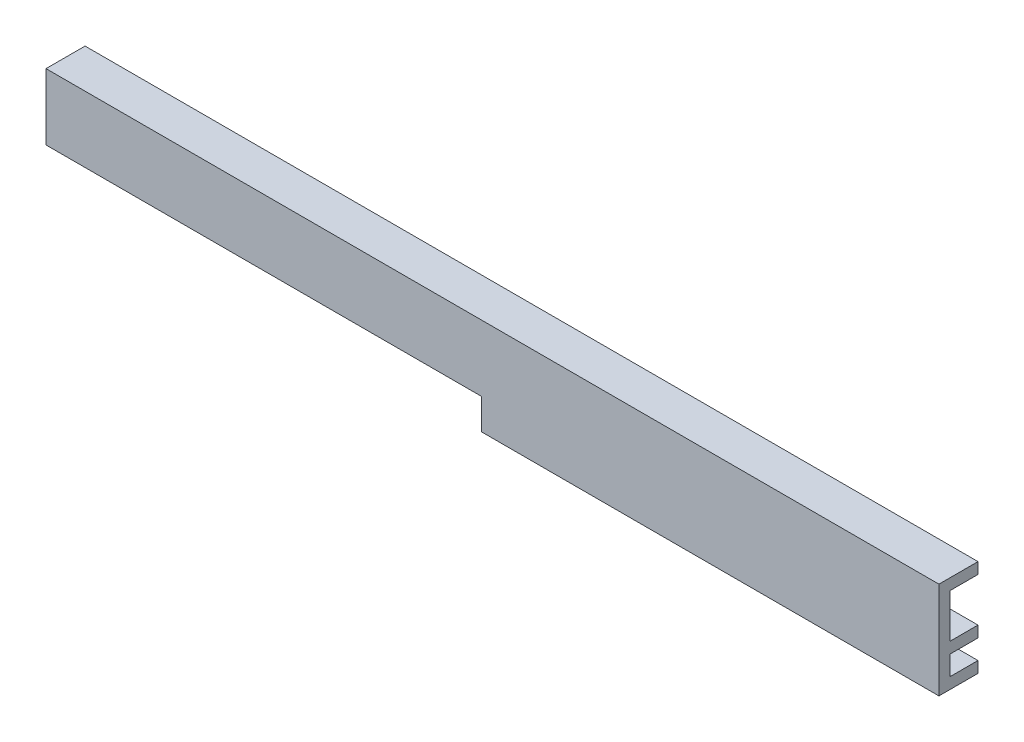
ISO-10303-21;
HEADER;
FILE_DESCRIPTION(('STEP AP214'),'2;1');
FILE_NAME('part.step','',(''),(''),'','','');
FILE_SCHEMA(('AUTOMOTIVE_DESIGN { 1 0 10303 214 1 1 1 1 }'));
ENDSEC;
DATA;
#1=APPLICATION_CONTEXT('core data for automotive mechanical design processes');
#2=APPLICATION_PROTOCOL_DEFINITION('international standard','automotive_design',2000,#1);
#3=PRODUCT_CONTEXT('',#1,'mechanical');
#4=PRODUCT('Part','Part','',(#3));
#5=PRODUCT_RELATED_PRODUCT_CATEGORY('part','',(#4));
#6=PRODUCT_DEFINITION_FORMATION('','',#4);
#7=PRODUCT_DEFINITION_CONTEXT('part definition',#1,'design');
#8=PRODUCT_DEFINITION('design','',#6,#7);
#9=PRODUCT_DEFINITION_SHAPE('','',#8);
#10=(LENGTH_UNIT() NAMED_UNIT(*) SI_UNIT(.MILLI.,.METRE.));
#11=(NAMED_UNIT(*) PLANE_ANGLE_UNIT() SI_UNIT($,.RADIAN.));
#12=(NAMED_UNIT(*) SI_UNIT($,.STERADIAN.) SOLID_ANGLE_UNIT());
#13=UNCERTAINTY_MEASURE_WITH_UNIT(LENGTH_MEASURE(1.E-05),#10,'distance_accuracy_value','');
#14=(GEOMETRIC_REPRESENTATION_CONTEXT(3) GLOBAL_UNCERTAINTY_ASSIGNED_CONTEXT((#13)) GLOBAL_UNIT_ASSIGNED_CONTEXT((#10,
#11,#12)) REPRESENTATION_CONTEXT('',''));
#15=CARTESIAN_POINT('',(0.,0.,0.));
#16=DIRECTION('',(0.,0.,1.));
#17=DIRECTION('',(1.,0.,0.));
#18=AXIS2_PLACEMENT_3D('',#15,#16,#17);
#19=CARTESIAN_POINT('',(0.,0.,0.));
#20=DIRECTION('',(0.,0.,1.));
#21=DIRECTION('',(1.,0.,0.));
#22=AXIS2_PLACEMENT_3D('',#19,#20,#21);
#23=PLANE('',#22);
#24=DIRECTION('',(1.,0.,0.));
#25=VECTOR('',#24,1.);
#26=CARTESIAN_POINT('',(0.,6.54114391143912,0.));
#27=LINE('',#26,#25);
#28=CARTESIAN_POINT('',(-39.2322075687125,6.54114391143912,0.));
#29=VERTEX_POINT('',#28);
#30=CARTESIAN_POINT('',(120.767792431288,6.54114391143914,0.));
#31=VERTEX_POINT('',#30);
#32=EDGE_CURVE('E181',#29,#31,#27,.T.);
#33=ORIENTED_EDGE('',*,*,#32,.F.);
#34=DIRECTION('',(0.,-1.,0.));
#35=VECTOR('',#34,1.);
#36=CARTESIAN_POINT('',(-39.2322075687125,1.36114062967681E-13,0.));
#37=LINE('',#36,#35);
#38=CARTESIAN_POINT('',(-39.2322075687125,14.3911439114391,0.));
#39=VERTEX_POINT('',#38);
#40=EDGE_CURVE('E143',#39,#29,#37,.T.);
#41=ORIENTED_EDGE('',*,*,#40,.F.);
#42=DIRECTION('',(1.,0.,0.));
#43=VECTOR('',#42,1.);
#44=CARTESIAN_POINT('',(0.,14.3911439114391,0.));
#45=LINE('',#44,#43);
#46=CARTESIAN_POINT('',(120.767792431288,14.3911439114391,0.));
#47=VERTEX_POINT('',#46);
#48=EDGE_CURVE('E226',#39,#47,#45,.T.);
#49=ORIENTED_EDGE('',*,*,#48,.T.);
#50=DIRECTION('',(0.,-1.,0.));
#51=VECTOR('',#50,1.);
#52=CARTESIAN_POINT('',(120.767792431288,-9.57708455645479E-13,0.));
#53=LINE('',#52,#51);
#54=EDGE_CURVE('E216',#47,#31,#53,.T.);
#55=ORIENTED_EDGE('',*,*,#54,.T.);
#56=EDGE_LOOP('',(#33,#41,#49,#55));
#57=FACE_BOUND('',#56,.T.);
#58=ADVANCED_FACE('F35',(#57),#23,.F.);
#59=DIRECTION('',(-1.,0.,0.));
#60=VECTOR('',#59,1.);
#61=CARTESIAN_POINT('',(0.,4.54114391143912,0.));
#62=LINE('',#61,#60);
#63=CARTESIAN_POINT('',(120.767792431288,4.54114391143913,0.));
#64=VERTEX_POINT('',#63);
#65=CARTESIAN_POINT('',(40.7677924312875,4.54114391143913,0.));
#66=VERTEX_POINT('',#65);
#67=EDGE_CURVE('E156',#64,#66,#62,.T.);
#68=ORIENTED_EDGE('',*,*,#67,.F.);
#69=CARTESIAN_POINT('',(120.767792431288,1.04114391143914,0.));
#70=VERTEX_POINT('',#69);
#71=EDGE_CURVE('E187',#64,#70,#53,.T.);
#72=ORIENTED_EDGE('',*,*,#71,.T.);
#73=DIRECTION('',(1.,0.,0.));
#74=VECTOR('',#73,1.);
#75=CARTESIAN_POINT('',(0.,1.04114391143912,0.));
#76=LINE('',#75,#74);
#77=CARTESIAN_POINT('',(40.7677924312875,1.04114391143913,0.));
#78=VERTEX_POINT('',#77);
#79=EDGE_CURVE('E57',#78,#70,#76,.T.);
#80=ORIENTED_EDGE('',*,*,#79,.F.);
#81=DIRECTION('',(0.,-1.,0.));
#82=VECTOR('',#81,1.);
#83=CARTESIAN_POINT('',(40.7677924312875,0.,0.));
#84=LINE('',#83,#82);
#85=EDGE_CURVE('E52',#66,#78,#84,.T.);
#86=ORIENTED_EDGE('',*,*,#85,.F.);
#87=EDGE_LOOP('',(#68,#72,#80,#86));
#88=FACE_BOUND('',#87,.T.);
#89=ADVANCED_FACE('F296',(#88),#23,.F.);
#90=CARTESIAN_POINT('',(0.,14.3911439114391,-5.));
#91=DIRECTION('',(0.,-1.,0.));
#92=DIRECTION('',(1.,0.,0.));
#93=AXIS2_PLACEMENT_3D('',#90,#91,#92);
#94=PLANE('',#93);
#95=ORIENTED_EDGE('',*,*,#48,.F.);
#96=DIRECTION('',(0.,0.,1.));
#97=VECTOR('',#96,1.);
#98=CARTESIAN_POINT('',(-39.2322075687125,14.3911439114391,-5.));
#99=LINE('',#98,#97);
#100=CARTESIAN_POINT('',(-39.2322075687125,14.3911439114391,-5.));
#101=VERTEX_POINT('',#100);
#102=EDGE_CURVE('E11',#101,#39,#99,.T.);
#103=ORIENTED_EDGE('',*,*,#102,.F.);
#104=DIRECTION('',(1.,0.,0.));
#105=VECTOR('',#104,1.);
#106=CARTESIAN_POINT('',(0.,14.3911439114391,-5.));
#107=LINE('',#106,#105);
#108=CARTESIAN_POINT('',(120.767792431288,14.3911439114391,-5.));
#109=VERTEX_POINT('',#108);
#110=EDGE_CURVE('E227',#101,#109,#107,.T.);
#111=ORIENTED_EDGE('',*,*,#110,.T.);
#112=DIRECTION('',(0.,0.,1.));
#113=VECTOR('',#112,1.);
#114=CARTESIAN_POINT('',(120.767792431288,14.3911439114391,-5.));
#115=LINE('',#114,#113);
#116=EDGE_CURVE('E39',#109,#47,#115,.T.);
#117=ORIENTED_EDGE('',*,*,#116,.T.);
#118=EDGE_LOOP('',(#95,#103,#111,#117));
#119=FACE_BOUND('',#118,.T.);
#120=ADVANCED_FACE('F37',(#119),#94,.T.);
#121=CARTESIAN_POINT('',(-39.2322075687125,0.,-5.));
#122=DIRECTION('',(1.,0.,0.));
#123=DIRECTION('',(0.,0.,-1.));
#124=AXIS2_PLACEMENT_3D('',#121,#122,#123);
#125=PLANE('',#124);
#126=ORIENTED_EDGE('',*,*,#102,.T.);
#127=ORIENTED_EDGE('',*,*,#40,.T.);
#128=DIRECTION('',(0.,0.,1.));
#129=VECTOR('',#128,1.);
#130=CARTESIAN_POINT('',(-39.2322075687125,6.54114391143912,-5.));
#131=LINE('',#130,#129);
#132=CARTESIAN_POINT('',(-39.2322075687125,6.54114391143912,-5.));
#133=VERTEX_POINT('',#132);
#134=EDGE_CURVE('E136',#133,#29,#131,.T.);
#135=ORIENTED_EDGE('',*,*,#134,.F.);
#136=DIRECTION('',(0.,-1.,0.));
#137=VECTOR('',#136,1.);
#138=CARTESIAN_POINT('',(-39.2322075687125,1.36114062967681E-13,-5.));
#139=LINE('',#138,#137);
#140=CARTESIAN_POINT('',(-39.2322075687125,4.54114391143912,-5.));
#141=VERTEX_POINT('',#140);
#142=EDGE_CURVE('E141',#133,#141,#139,.T.);
#143=ORIENTED_EDGE('',*,*,#142,.T.);
#144=DIRECTION('',(0.,0.,-1.));
#145=VECTOR('',#144,1.);
#146=CARTESIAN_POINT('',(-39.2322075687125,4.54114391143912,2.));
#147=LINE('',#146,#145);
#148=CARTESIAN_POINT('',(-39.2322075687125,4.54114391143912,2.));
#149=VERTEX_POINT('',#148);
#150=EDGE_CURVE('E215',#149,#141,#147,.T.);
#151=ORIENTED_EDGE('',*,*,#150,.F.);
#152=DIRECTION('',(0.,-1.,0.));
#153=VECTOR('',#152,1.);
#154=CARTESIAN_POINT('',(-39.2322075687125,1.36114062967681E-13,2.));
#155=LINE('',#154,#153);
#156=CARTESIAN_POINT('',(-39.2322075687125,16.3911439114391,2.));
#157=VERTEX_POINT('',#156);
#158=EDGE_CURVE('E213',#157,#149,#155,.T.);
#159=ORIENTED_EDGE('',*,*,#158,.F.);
#160=DIRECTION('',(0.,0.,1.));
#161=VECTOR('',#160,1.);
#162=CARTESIAN_POINT('',(-39.2322075687125,16.3911439114391,-5.));
#163=LINE('',#162,#161);
#164=CARTESIAN_POINT('',(-39.2322075687125,16.3911439114391,-5.));
#165=VERTEX_POINT('',#164);
#166=EDGE_CURVE('E44',#165,#157,#163,.T.);
#167=ORIENTED_EDGE('',*,*,#166,.F.);
#168=DIRECTION('',(0.,1.,0.));
#169=VECTOR('',#168,1.);
#170=CARTESIAN_POINT('',(-39.2322075687125,0.,-5.));
#171=LINE('',#170,#169);
#172=EDGE_CURVE('E235',#101,#165,#171,.T.);
#173=ORIENTED_EDGE('',*,*,#172,.F.);
#174=EDGE_LOOP('',(#126,#127,#135,#143,#151,#159,#167,#173));
#175=FACE_BOUND('',#174,.T.);
#176=ADVANCED_FACE('F138',(#175),#125,.F.);
#177=CARTESIAN_POINT('',(0.,16.3911439114391,-5.));
#178=DIRECTION('',(0.,-1.,0.));
#179=DIRECTION('',(1.,0.,0.));
#180=AXIS2_PLACEMENT_3D('',#177,#178,#179);
#181=PLANE('',#180);
#182=ORIENTED_EDGE('',*,*,#166,.T.);
#183=DIRECTION('',(1.,0.,0.));
#184=VECTOR('',#183,1.);
#185=CARTESIAN_POINT('',(0.,16.3911439114391,2.));
#186=LINE('',#185,#184);
#187=CARTESIAN_POINT('',(120.767792431288,16.3911439114391,2.));
#188=VERTEX_POINT('',#187);
#189=EDGE_CURVE('E210',#157,#188,#186,.T.);
#190=ORIENTED_EDGE('',*,*,#189,.T.);
#191=DIRECTION('',(0.,0.,1.));
#192=VECTOR('',#191,1.);
#193=CARTESIAN_POINT('',(120.767792431288,16.3911439114391,-5.));
#194=LINE('',#193,#192);
#195=CARTESIAN_POINT('',(120.767792431288,16.3911439114391,-5.));
#196=VERTEX_POINT('',#195);
#197=EDGE_CURVE('E239',#196,#188,#194,.T.);
#198=ORIENTED_EDGE('',*,*,#197,.F.);
#199=DIRECTION('',(1.,0.,0.));
#200=VECTOR('',#199,1.);
#201=CARTESIAN_POINT('',(0.,16.3911439114391,-5.));
#202=LINE('',#201,#200);
#203=EDGE_CURVE('E233',#165,#196,#202,.T.);
#204=ORIENTED_EDGE('',*,*,#203,.F.);
#205=EDGE_LOOP('',(#182,#190,#198,#204));
#206=FACE_BOUND('',#205,.T.);
#207=ADVANCED_FACE('F284',(#206),#181,.F.);
#208=CARTESIAN_POINT('',(120.767792431287,-1.67598979737958E-12,-5.));
#209=DIRECTION('',(1.,0.,0.));
#210=DIRECTION('',(0.,1.,0.));
#211=AXIS2_PLACEMENT_3D('',#208,#209,#210);
#212=PLANE('',#211);
#213=ORIENTED_EDGE('',*,*,#197,.T.);
#214=DIRECTION('',(0.,-1.,0.));
#215=VECTOR('',#214,1.);
#216=CARTESIAN_POINT('',(120.767792431288,-9.57708455645479E-13,2.));
#217=LINE('',#216,#215);
#218=CARTESIAN_POINT('',(120.767792431288,-0.958856088560861,2.));
#219=VERTEX_POINT('',#218);
#220=EDGE_CURVE('E207',#188,#219,#217,.T.);
#221=ORIENTED_EDGE('',*,*,#220,.T.);
#222=DIRECTION('',(0.,0.,-1.));
#223=VECTOR('',#222,1.);
#224=CARTESIAN_POINT('',(120.767792431288,-0.958856088560861,2.));
#225=LINE('',#224,#223);
#226=CARTESIAN_POINT('',(120.767792431288,-0.958856088560861,-5.));
#227=VERTEX_POINT('',#226);
#228=EDGE_CURVE('E220',#219,#227,#225,.T.);
#229=ORIENTED_EDGE('',*,*,#228,.T.);
#230=DIRECTION('',(0.,-1.,0.));
#231=VECTOR('',#230,1.);
#232=CARTESIAN_POINT('',(120.767792431288,0.,-5.));
#233=LINE('',#232,#231);
#234=CARTESIAN_POINT('',(120.767792431288,1.04114391143914,-5.));
#235=VERTEX_POINT('',#234);
#236=EDGE_CURVE('E173',#235,#227,#233,.T.);
#237=ORIENTED_EDGE('',*,*,#236,.F.);
#238=DIRECTION('',(0.,0.,1.));
#239=VECTOR('',#238,1.);
#240=CARTESIAN_POINT('',(120.767792431288,1.04114391143914,-5.));
#241=LINE('',#240,#239);
#242=EDGE_CURVE('E146',#235,#70,#241,.T.);
#243=ORIENTED_EDGE('',*,*,#242,.T.);
#244=ORIENTED_EDGE('',*,*,#71,.F.);
#245=DIRECTION('',(0.,0.,1.));
#246=VECTOR('',#245,1.);
#247=CARTESIAN_POINT('',(120.767792431288,4.54114391143914,-5.));
#248=LINE('',#247,#246);
#249=CARTESIAN_POINT('',(120.767792431288,4.54114391143914,-5.));
#250=VERTEX_POINT('',#249);
#251=EDGE_CURVE('E188',#250,#64,#248,.T.);
#252=ORIENTED_EDGE('',*,*,#251,.F.);
#253=DIRECTION('',(0.,-1.,0.));
#254=VECTOR('',#253,1.);
#255=CARTESIAN_POINT('',(120.767792431288,1.67598979737959E-12,-5.));
#256=LINE('',#255,#254);
#257=CARTESIAN_POINT('',(120.767792431288,6.54114391143914,-5.));
#258=VERTEX_POINT('',#257);
#259=EDGE_CURVE('E147',#258,#250,#256,.T.);
#260=ORIENTED_EDGE('',*,*,#259,.F.);
#261=DIRECTION('',(0.,0.,1.));
#262=VECTOR('',#261,1.);
#263=CARTESIAN_POINT('',(120.767792431288,6.54114391143914,-5.));
#264=LINE('',#263,#262);
#265=EDGE_CURVE('E154',#258,#31,#264,.T.);
#266=ORIENTED_EDGE('',*,*,#265,.T.);
#267=ORIENTED_EDGE('',*,*,#54,.F.);
#268=ORIENTED_EDGE('',*,*,#116,.F.);
#269=DIRECTION('',(0.,1.,0.));
#270=VECTOR('',#269,1.);
#271=CARTESIAN_POINT('',(120.767792431287,-1.67598979737958E-12,-5.));
#272=LINE('',#271,#270);
#273=EDGE_CURVE('E230',#109,#196,#272,.T.);
#274=ORIENTED_EDGE('',*,*,#273,.T.);
#275=EDGE_LOOP('',(#213,#221,#229,#237,#243,#244,#252,#260,#266,#267,#268,#274));
#276=FACE_BOUND('',#275,.T.);
#277=ADVANCED_FACE('F249',(#276),#212,.T.);
#278=CARTESIAN_POINT('',(0.,0.,-5.));
#279=DIRECTION('',(0.,0.,1.));
#280=DIRECTION('',(1.,0.,0.));
#281=AXIS2_PLACEMENT_3D('',#278,#279,#280);
#282=PLANE('',#281);
#283=ORIENTED_EDGE('',*,*,#110,.F.);
#284=ORIENTED_EDGE('',*,*,#172,.T.);
#285=ORIENTED_EDGE('',*,*,#203,.T.);
#286=ORIENTED_EDGE('',*,*,#273,.F.);
#287=EDGE_LOOP('',(#283,#284,#285,#286));
#288=FACE_BOUND('',#287,.T.);
#289=ADVANCED_FACE('F286',(#288),#282,.F.);
#290=CARTESIAN_POINT('',(0.,4.54114391143912,2.));
#291=DIRECTION('',(0.,-1.,0.));
#292=DIRECTION('',(1.,0.,0.));
#293=AXIS2_PLACEMENT_3D('',#290,#291,#292);
#294=PLANE('',#293);
#295=ORIENTED_EDGE('',*,*,#150,.T.);
#296=DIRECTION('',(-1.,0.,0.));
#297=VECTOR('',#296,1.);
#298=CARTESIAN_POINT('',(0.,4.54114391143912,-5.));
#299=LINE('',#298,#297);
#300=CARTESIAN_POINT('',(38.7677924312875,4.54114391143913,-5.));
#301=VERTEX_POINT('',#300);
#302=EDGE_CURVE('E162',#301,#141,#299,.T.);
#303=ORIENTED_EDGE('',*,*,#302,.F.);
#304=DIRECTION('',(0.,0.,-1.));
#305=VECTOR('',#304,1.);
#306=CARTESIAN_POINT('',(38.7677924312875,4.54114391143913,2.));
#307=LINE('',#306,#305);
#308=CARTESIAN_POINT('',(38.7677924312875,4.54114391143913,2.));
#309=VERTEX_POINT('',#308);
#310=EDGE_CURVE('E224',#309,#301,#307,.T.);
#311=ORIENTED_EDGE('',*,*,#310,.F.);
#312=DIRECTION('',(-1.,0.,0.));
#313=VECTOR('',#312,1.);
#314=CARTESIAN_POINT('',(0.,4.54114391143912,2.));
#315=LINE('',#314,#313);
#316=EDGE_CURVE('E199',#309,#149,#315,.T.);
#317=ORIENTED_EDGE('',*,*,#316,.T.);
#318=EDGE_LOOP('',(#295,#303,#311,#317));
#319=FACE_BOUND('',#318,.T.);
#320=ADVANCED_FACE('F275',(#319),#294,.T.);
#321=CARTESIAN_POINT('',(38.7677924312875,0.,2.));
#322=DIRECTION('',(1.,0.,0.));
#323=DIRECTION('',(0.,0.,-1.));
#324=AXIS2_PLACEMENT_3D('',#321,#322,#323);
#325=PLANE('',#324);
#326=ORIENTED_EDGE('',*,*,#310,.T.);
#327=DIRECTION('',(0.,-1.,0.));
#328=VECTOR('',#327,1.);
#329=CARTESIAN_POINT('',(38.7677924312875,0.,-5.));
#330=LINE('',#329,#328);
#331=CARTESIAN_POINT('',(38.7677924312875,-0.958856088560872,-5.));
#332=VERTEX_POINT('',#331);
#333=EDGE_CURVE('E164',#301,#332,#330,.T.);
#334=ORIENTED_EDGE('',*,*,#333,.T.);
#335=DIRECTION('',(0.,0.,-1.));
#336=VECTOR('',#335,1.);
#337=CARTESIAN_POINT('',(38.7677924312875,-0.958856088560872,2.));
#338=LINE('',#337,#336);
#339=CARTESIAN_POINT('',(38.7677924312875,-0.958856088560872,2.));
#340=VERTEX_POINT('',#339);
#341=EDGE_CURVE('E222',#340,#332,#338,.T.);
#342=ORIENTED_EDGE('',*,*,#341,.F.);
#343=DIRECTION('',(0.,-1.,0.));
#344=VECTOR('',#343,1.);
#345=CARTESIAN_POINT('',(38.7677924312875,0.,2.));
#346=LINE('',#345,#344);
#347=EDGE_CURVE('E202',#309,#340,#346,.T.);
#348=ORIENTED_EDGE('',*,*,#347,.F.);
#349=EDGE_LOOP('',(#326,#334,#342,#348));
#350=FACE_BOUND('',#349,.T.);
#351=ADVANCED_FACE('F272',(#350),#325,.F.);
#352=CARTESIAN_POINT('',(0.,-0.958856088560876,2.));
#353=DIRECTION('',(0.,-1.,0.));
#354=DIRECTION('',(1.,0.,0.));
#355=AXIS2_PLACEMENT_3D('',#352,#353,#354);
#356=PLANE('',#355);
#357=ORIENTED_EDGE('',*,*,#341,.T.);
#358=DIRECTION('',(-1.,0.,0.));
#359=VECTOR('',#358,1.);
#360=CARTESIAN_POINT('',(0.,-0.958856088560878,-5.));
#361=LINE('',#360,#359);
#362=EDGE_CURVE('E170',#227,#332,#361,.T.);
#363=ORIENTED_EDGE('',*,*,#362,.F.);
#364=ORIENTED_EDGE('',*,*,#228,.F.);
#365=DIRECTION('',(-1.,0.,0.));
#366=VECTOR('',#365,1.);
#367=CARTESIAN_POINT('',(0.,-0.958856088560876,2.));
#368=LINE('',#367,#366);
#369=EDGE_CURVE('E204',#219,#340,#368,.T.);
#370=ORIENTED_EDGE('',*,*,#369,.T.);
#371=EDGE_LOOP('',(#357,#363,#364,#370));
#372=FACE_BOUND('',#371,.T.);
#373=ADVANCED_FACE('F267',(#372),#356,.T.);
#374=CARTESIAN_POINT('',(0.,0.,2.));
#375=DIRECTION('',(0.,0.,1.));
#376=DIRECTION('',(1.,0.,0.));
#377=AXIS2_PLACEMENT_3D('',#374,#375,#376);
#378=PLANE('',#377);
#379=ORIENTED_EDGE('',*,*,#316,.F.);
#380=ORIENTED_EDGE('',*,*,#347,.T.);
#381=ORIENTED_EDGE('',*,*,#369,.F.);
#382=ORIENTED_EDGE('',*,*,#220,.F.);
#383=ORIENTED_EDGE('',*,*,#189,.F.);
#384=ORIENTED_EDGE('',*,*,#158,.T.);
#385=EDGE_LOOP('',(#379,#380,#381,#382,#383,#384));
#386=FACE_BOUND('',#385,.T.);
#387=ADVANCED_FACE('F282',(#386),#378,.T.);
#388=CARTESIAN_POINT('',(0.,6.54114391143912,-5.));
#389=DIRECTION('',(0.,-1.,0.));
#390=DIRECTION('',(1.,0.,0.));
#391=AXIS2_PLACEMENT_3D('',#388,#389,#390);
#392=PLANE('',#391);
#393=ORIENTED_EDGE('',*,*,#32,.T.);
#394=ORIENTED_EDGE('',*,*,#265,.F.);
#395=DIRECTION('',(1.,0.,0.));
#396=VECTOR('',#395,1.);
#397=CARTESIAN_POINT('',(0.,6.54114391143912,-5.));
#398=LINE('',#397,#396);
#399=EDGE_CURVE('E151',#133,#258,#398,.T.);
#400=ORIENTED_EDGE('',*,*,#399,.F.);
#401=ORIENTED_EDGE('',*,*,#134,.T.);
#402=EDGE_LOOP('',(#393,#394,#400,#401));
#403=FACE_BOUND('',#402,.T.);
#404=ADVANCED_FACE('F152',(#403),#392,.F.);
#405=CARTESIAN_POINT('',(0.,4.54114391143912,-5.));
#406=DIRECTION('',(0.,1.,0.));
#407=DIRECTION('',(-1.,0.,0.));
#408=AXIS2_PLACEMENT_3D('',#405,#406,#407);
#409=PLANE('',#408);
#410=ORIENTED_EDGE('',*,*,#67,.T.);
#411=DIRECTION('',(0.,0.,1.));
#412=VECTOR('',#411,1.);
#413=CARTESIAN_POINT('',(40.7677924312875,4.54114391143913,-5.));
#414=LINE('',#413,#412);
#415=CARTESIAN_POINT('',(40.7677924312875,4.54114391143913,-5.));
#416=VERTEX_POINT('',#415);
#417=EDGE_CURVE('E191',#416,#66,#414,.T.);
#418=ORIENTED_EDGE('',*,*,#417,.F.);
#419=EDGE_CURVE('E166',#250,#416,#299,.T.);
#420=ORIENTED_EDGE('',*,*,#419,.F.);
#421=ORIENTED_EDGE('',*,*,#251,.T.);
#422=EDGE_LOOP('',(#410,#418,#420,#421));
#423=FACE_BOUND('',#422,.T.);
#424=ADVANCED_FACE('F257',(#423),#409,.F.);
#425=CARTESIAN_POINT('',(40.7677924312875,0.,-5.));
#426=DIRECTION('',(-1.,0.,0.));
#427=DIRECTION('',(0.,0.,1.));
#428=AXIS2_PLACEMENT_3D('',#425,#426,#427);
#429=PLANE('',#428);
#430=ORIENTED_EDGE('',*,*,#85,.T.);
#431=DIRECTION('',(0.,0.,1.));
#432=VECTOR('',#431,1.);
#433=CARTESIAN_POINT('',(40.7677924312875,1.04114391143913,-5.));
#434=LINE('',#433,#432);
#435=CARTESIAN_POINT('',(40.7677924312875,1.04114391143913,-5.));
#436=VERTEX_POINT('',#435);
#437=EDGE_CURVE('E194',#436,#78,#434,.T.);
#438=ORIENTED_EDGE('',*,*,#437,.F.);
#439=DIRECTION('',(0.,-1.,0.));
#440=VECTOR('',#439,1.);
#441=CARTESIAN_POINT('',(40.7677924312875,0.,-5.));
#442=LINE('',#441,#440);
#443=EDGE_CURVE('E178',#416,#436,#442,.T.);
#444=ORIENTED_EDGE('',*,*,#443,.F.);
#445=ORIENTED_EDGE('',*,*,#417,.T.);
#446=EDGE_LOOP('',(#430,#438,#444,#445));
#447=FACE_BOUND('',#446,.T.);
#448=ADVANCED_FACE('F259',(#447),#429,.F.);
#449=CARTESIAN_POINT('',(0.,1.04114391143912,-5.));
#450=DIRECTION('',(0.,-1.,0.));
#451=DIRECTION('',(1.,0.,0.));
#452=AXIS2_PLACEMENT_3D('',#449,#450,#451);
#453=PLANE('',#452);
#454=ORIENTED_EDGE('',*,*,#79,.T.);
#455=ORIENTED_EDGE('',*,*,#242,.F.);
#456=DIRECTION('',(1.,0.,0.));
#457=VECTOR('',#456,1.);
#458=CARTESIAN_POINT('',(0.,1.04114391143912,-5.));
#459=LINE('',#458,#457);
#460=EDGE_CURVE('E176',#436,#235,#459,.T.);
#461=ORIENTED_EDGE('',*,*,#460,.F.);
#462=ORIENTED_EDGE('',*,*,#437,.T.);
#463=EDGE_LOOP('',(#454,#455,#461,#462));
#464=FACE_BOUND('',#463,.T.);
#465=ADVANCED_FACE('F263',(#464),#453,.F.);
#466=CARTESIAN_POINT('',(0.,0.,-5.));
#467=DIRECTION('',(0.,0.,1.));
#468=DIRECTION('',(1.,0.,0.));
#469=AXIS2_PLACEMENT_3D('',#466,#467,#468);
#470=PLANE('',#469);
#471=ORIENTED_EDGE('',*,*,#399,.T.);
#472=ORIENTED_EDGE('',*,*,#259,.T.);
#473=ORIENTED_EDGE('',*,*,#419,.T.);
#474=ORIENTED_EDGE('',*,*,#443,.T.);
#475=ORIENTED_EDGE('',*,*,#460,.T.);
#476=ORIENTED_EDGE('',*,*,#236,.T.);
#477=ORIENTED_EDGE('',*,*,#362,.T.);
#478=ORIENTED_EDGE('',*,*,#333,.F.);
#479=ORIENTED_EDGE('',*,*,#302,.T.);
#480=ORIENTED_EDGE('',*,*,#142,.F.);
#481=EDGE_LOOP('',(#471,#472,#473,#474,#475,#476,#477,#478,#479,#480));
#482=FACE_BOUND('',#481,.T.);
#483=ADVANCED_FACE('F159',(#482),#470,.F.);
#484=CLOSED_SHELL('',(#58,#89,#120,#176,#207,#277,#289,#320,#351,#373,#387,#404,#424,#448,#465,#483));
#485=MANIFOLD_SOLID_BREP('B2',#484);
#486=ADVANCED_BREP_SHAPE_REPRESENTATION('',(#18,#485),#14);
#487=SHAPE_DEFINITION_REPRESENTATION(#9,#486);
ENDSEC;
END-ISO-10303-21;
